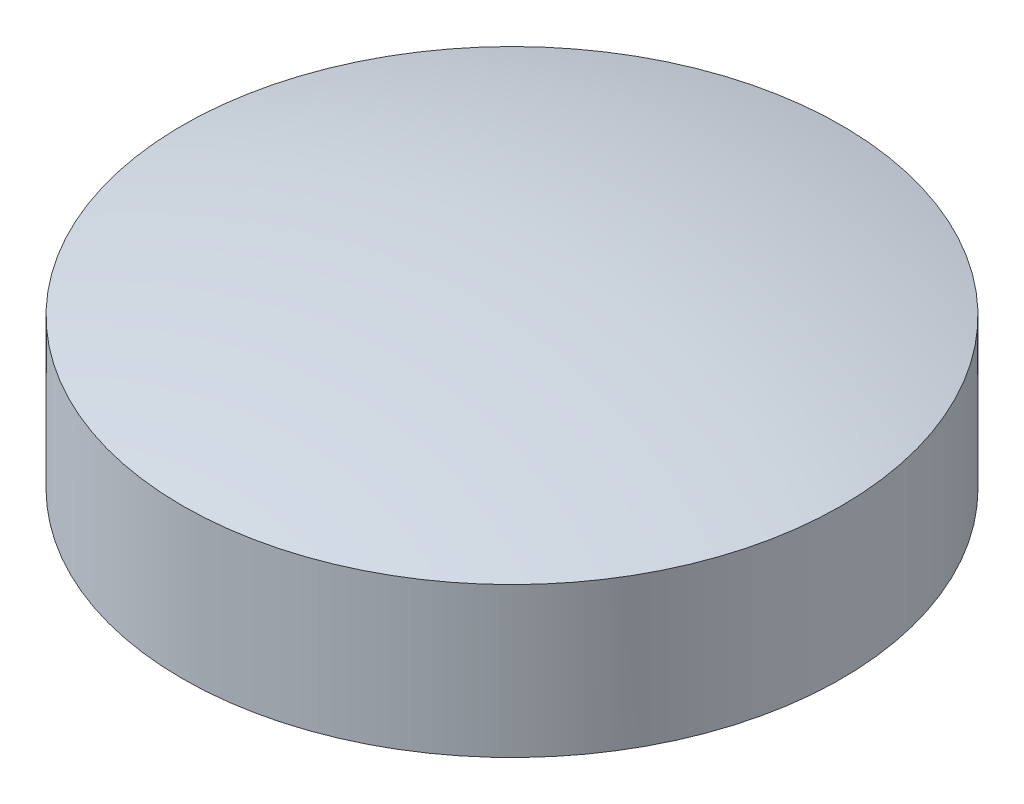
ISO-10303-21;
HEADER;
FILE_DESCRIPTION(('STEP AP214'),'2;1');
FILE_NAME('part.step','',(''),(''),'','','');
FILE_SCHEMA(('AUTOMOTIVE_DESIGN { 1 0 10303 214 1 1 1 1 }'));
ENDSEC;
DATA;
#1=APPLICATION_CONTEXT('core data for automotive mechanical design processes');
#2=APPLICATION_PROTOCOL_DEFINITION('international standard','automotive_design',2000,#1);
#3=PRODUCT_CONTEXT('',#1,'mechanical');
#4=PRODUCT('Part','Part','',(#3));
#5=PRODUCT_RELATED_PRODUCT_CATEGORY('part','',(#4));
#6=PRODUCT_DEFINITION_FORMATION('','',#4);
#7=PRODUCT_DEFINITION_CONTEXT('part definition',#1,'design');
#8=PRODUCT_DEFINITION('design','',#6,#7);
#9=PRODUCT_DEFINITION_SHAPE('','',#8);
#10=(LENGTH_UNIT() NAMED_UNIT(*) SI_UNIT(.MILLI.,.METRE.));
#11=(NAMED_UNIT(*) PLANE_ANGLE_UNIT() SI_UNIT($,.RADIAN.));
#12=(NAMED_UNIT(*) SI_UNIT($,.STERADIAN.) SOLID_ANGLE_UNIT());
#13=UNCERTAINTY_MEASURE_WITH_UNIT(LENGTH_MEASURE(1.E-05),#10,'distance_accuracy_value','');
#14=(GEOMETRIC_REPRESENTATION_CONTEXT(3) GLOBAL_UNCERTAINTY_ASSIGNED_CONTEXT((#13)) GLOBAL_UNIT_ASSIGNED_CONTEXT((#10,
#11,#12)) REPRESENTATION_CONTEXT('',''));
#15=CARTESIAN_POINT('',(0.,0.,0.));
#16=DIRECTION('',(0.,0.,1.));
#17=DIRECTION('',(1.,0.,0.));
#18=AXIS2_PLACEMENT_3D('',#15,#16,#17);
#19=CARTESIAN_POINT('',(0.,-69.1666666666666,0.));
#20=DIRECTION('',(0.,1.,0.));
#21=DIRECTION('',(1.,0.,0.));
#22=AXIS2_PLACEMENT_3D('',#19,#20,#21);
#23=SPHERICAL_SURFACE('',#22,82.1666666666666);
#24=CARTESIAN_POINT('',(0.,9.99999999999999,0.));
#25=DIRECTION('',(0.,1.,0.));
#26=DIRECTION('',(0.,0.,1.));
#27=AXIS2_PLACEMENT_3D('',#24,#25,#26);
#28=CIRCLE('',#27,22.);
#29=CARTESIAN_POINT('',(0.,9.99999999999999,22.));
#30=VERTEX_POINT('',#29);
#31=EDGE_CURVE('E40',#30,#30,#28,.T.);
#32=ORIENTED_EDGE('',*,*,#31,.T.);
#33=EDGE_LOOP('',(#32));
#34=FACE_BOUND('',#33,.T.);
#35=ADVANCED_FACE('F33',(#34),#23,.T.);
#36=CARTESIAN_POINT('',(0.,48.7647020311831,0.));
#37=DIRECTION('',(0.,1.,0.));
#38=DIRECTION('',(0.,0.,1.));
#39=AXIS2_PLACEMENT_3D('',#36,#37,#38);
#40=CYLINDRICAL_SURFACE('',#39,22.);
#41=ORIENTED_EDGE('',*,*,#31,.F.);
#42=EDGE_LOOP('',(#41));
#43=FACE_BOUND('',#42,.T.);
#44=CARTESIAN_POINT('',(0.,5.,0.));
#45=DIRECTION('',(0.,-1.,0.));
#46=DIRECTION('',(0.,0.,-1.));
#47=AXIS2_PLACEMENT_3D('',#44,#45,#46);
#48=CIRCLE('',#47,22.);
#49=CARTESIAN_POINT('',(-21.9488636363636,5.,1.49912810403716));
#50=VERTEX_POINT('',#49);
#51=CARTESIAN_POINT('',(-21.9488636363636,5.,-1.49912810403716));
#52=VERTEX_POINT('',#51);
#53=EDGE_CURVE('E11',#50,#52,#48,.T.);
#54=ORIENTED_EDGE('',*,*,#53,.F.);
#55=DIRECTION('',(0.,-1.,0.));
#56=VECTOR('',#55,1.);
#57=CARTESIAN_POINT('',(-21.9488636363636,2.5,1.49912810403716));
#58=LINE('',#57,#56);
#59=CARTESIAN_POINT('',(-21.9488636363636,0.,1.49912810403716));
#60=VERTEX_POINT('',#59);
#61=EDGE_CURVE('E63',#50,#60,#58,.T.);
#62=ORIENTED_EDGE('',*,*,#61,.T.);
#63=CARTESIAN_POINT('',(0.,0.,0.));
#64=DIRECTION('',(0.,1.,0.));
#65=DIRECTION('',(0.,0.,1.));
#66=AXIS2_PLACEMENT_3D('',#63,#64,#65);
#67=CIRCLE('',#66,22.);
#68=CARTESIAN_POINT('',(-21.9488636363636,0.,-1.49912810403717));
#69=VERTEX_POINT('',#68);
#70=EDGE_CURVE('E68',#60,#69,#67,.T.);
#71=ORIENTED_EDGE('',*,*,#70,.T.);
#72=DIRECTION('',(0.,-1.,0.));
#73=VECTOR('',#72,1.);
#74=CARTESIAN_POINT('',(-21.9488636363636,2.5,-1.49912810403716));
#75=LINE('',#74,#73);
#76=EDGE_CURVE('E47',#69,#52,#75,.F.);
#77=ORIENTED_EDGE('',*,*,#76,.T.);
#78=EDGE_LOOP('',(#54,#62,#71,#77));
#79=FACE_BOUND('',#78,.T.);
#80=ADVANCED_FACE('F66',(#43,#79),#40,.T.);
#81=CARTESIAN_POINT('',(0.,0.,0.));
#82=DIRECTION('',(0.,1.,0.));
#83=DIRECTION('',(0.,0.,1.));
#84=AXIS2_PLACEMENT_3D('',#81,#82,#83);
#85=PLANE('',#84);
#86=ORIENTED_EDGE('',*,*,#70,.F.);
#87=CARTESIAN_POINT('',(-22.,0.,0.));
#88=DIRECTION('',(0.,-1.,0.));
#89=DIRECTION('',(0.,0.,-1.));
#90=AXIS2_PLACEMENT_3D('',#87,#88,#89);
#91=CIRCLE('',#90,1.5);
#92=EDGE_CURVE('E51',#69,#60,#91,.T.);
#93=ORIENTED_EDGE('',*,*,#92,.F.);
#94=EDGE_LOOP('',(#86,#93));
#95=FACE_BOUND('',#94,.T.);
#96=ADVANCED_FACE('F78',(#95),#85,.F.);
#97=CARTESIAN_POINT('',(-22.,5.,0.));
#98=DIRECTION('',(0.,-1.,0.));
#99=DIRECTION('',(0.,0.,-1.));
#100=AXIS2_PLACEMENT_3D('',#97,#98,#99);
#101=PLANE('',#100);
#102=ORIENTED_EDGE('',*,*,#53,.T.);
#103=CARTESIAN_POINT('',(-22.,5.,0.));
#104=DIRECTION('',(0.,-1.,0.));
#105=DIRECTION('',(0.,0.,-1.));
#106=AXIS2_PLACEMENT_3D('',#103,#104,#105);
#107=CIRCLE('',#106,1.5);
#108=EDGE_CURVE('E60',#52,#50,#107,.T.);
#109=ORIENTED_EDGE('',*,*,#108,.T.);
#110=EDGE_LOOP('',(#102,#109));
#111=FACE_BOUND('',#110,.T.);
#112=ADVANCED_FACE('F59',(#111),#101,.T.);
#113=CARTESIAN_POINT('',(-22.,5.,0.));
#114=DIRECTION('',(0.,-1.,0.));
#115=DIRECTION('',(0.,0.,-1.));
#116=AXIS2_PLACEMENT_3D('',#113,#114,#115);
#117=CYLINDRICAL_SURFACE('',#116,1.5);
#118=ORIENTED_EDGE('',*,*,#108,.F.);
#119=ORIENTED_EDGE('',*,*,#76,.F.);
#120=ORIENTED_EDGE('',*,*,#92,.T.);
#121=ORIENTED_EDGE('',*,*,#61,.F.);
#122=EDGE_LOOP('',(#118,#119,#120,#121));
#123=FACE_BOUND('',#122,.T.);
#124=ADVANCED_FACE('F62',(#123),#117,.F.);
#125=CLOSED_SHELL('',(#35,#80,#96,#112,#124));
#126=MANIFOLD_SOLID_BREP('B2',#125);
#127=ADVANCED_BREP_SHAPE_REPRESENTATION('',(#18,#126),#14);
#128=SHAPE_DEFINITION_REPRESENTATION(#9,#127);
ENDSEC;
END-ISO-10303-21;
